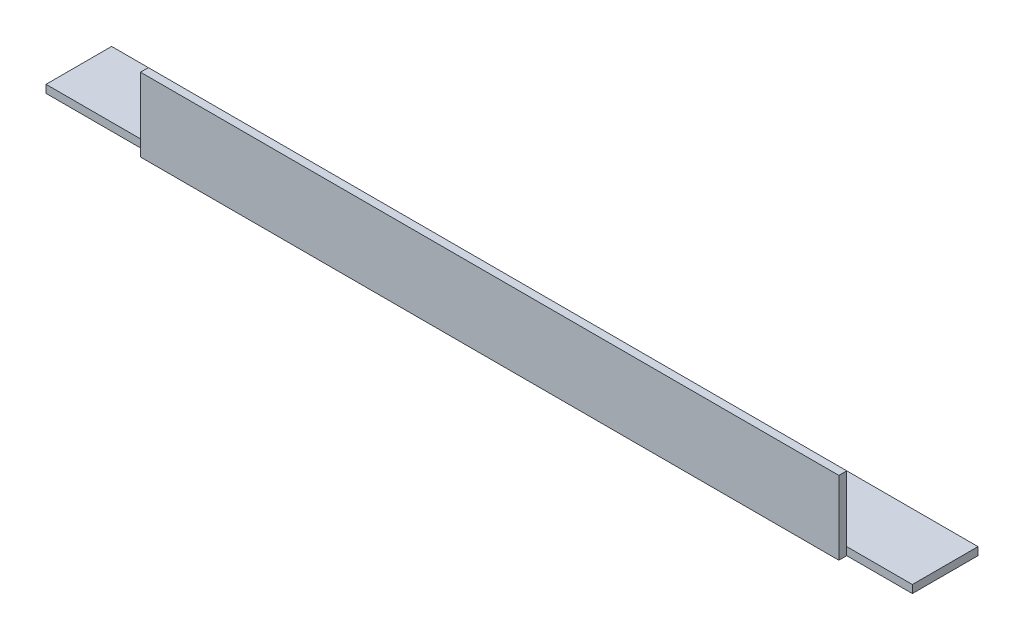
ISO-10303-21;
HEADER;
FILE_DESCRIPTION(('STEP AP214'),'2;1');
FILE_NAME('part.step','',(''),(''),'','','');
FILE_SCHEMA(('AUTOMOTIVE_DESIGN { 1 0 10303 214 1 1 1 1 }'));
ENDSEC;
DATA;
#1=APPLICATION_CONTEXT('core data for automotive mechanical design processes');
#2=APPLICATION_PROTOCOL_DEFINITION('international standard','automotive_design',2000,#1);
#3=PRODUCT_CONTEXT('',#1,'mechanical');
#4=PRODUCT('Part','Part','',(#3));
#5=PRODUCT_RELATED_PRODUCT_CATEGORY('part','',(#4));
#6=PRODUCT_DEFINITION_FORMATION('','',#4);
#7=PRODUCT_DEFINITION_CONTEXT('part definition',#1,'design');
#8=PRODUCT_DEFINITION('design','',#6,#7);
#9=PRODUCT_DEFINITION_SHAPE('','',#8);
#10=(LENGTH_UNIT() NAMED_UNIT(*) SI_UNIT(.MILLI.,.METRE.));
#11=(NAMED_UNIT(*) PLANE_ANGLE_UNIT() SI_UNIT($,.RADIAN.));
#12=(NAMED_UNIT(*) SI_UNIT($,.STERADIAN.) SOLID_ANGLE_UNIT());
#13=UNCERTAINTY_MEASURE_WITH_UNIT(LENGTH_MEASURE(1.E-05),#10,'distance_accuracy_value','');
#14=(GEOMETRIC_REPRESENTATION_CONTEXT(3) GLOBAL_UNCERTAINTY_ASSIGNED_CONTEXT((#13)) GLOBAL_UNIT_ASSIGNED_CONTEXT((#10,
#11,#12)) REPRESENTATION_CONTEXT('',''));
#15=CARTESIAN_POINT('',(0.,0.,0.));
#16=DIRECTION('',(0.,0.,1.));
#17=DIRECTION('',(1.,0.,0.));
#18=AXIS2_PLACEMENT_3D('',#15,#16,#17);
#19=CARTESIAN_POINT('',(330.,-3.,0.));
#20=DIRECTION('',(0.,1.,0.));
#21=DIRECTION('',(0.,0.,1.));
#22=AXIS2_PLACEMENT_3D('',#19,#20,#21);
#23=PLANE('',#22);
#24=DIRECTION('',(0.,0.,-1.));
#25=VECTOR('',#24,1.);
#26=CARTESIAN_POINT('',(330.,-3.,0.));
#27=LINE('',#26,#25);
#28=CARTESIAN_POINT('',(330.,-3.,0.));
#29=VERTEX_POINT('',#28);
#30=CARTESIAN_POINT('',(330.,-3.,-25.));
#31=VERTEX_POINT('',#30);
#32=EDGE_CURVE('E97',#29,#31,#27,.T.);
#33=ORIENTED_EDGE('',*,*,#32,.F.);
#34=DIRECTION('',(1.,0.,0.));
#35=VECTOR('',#34,1.);
#36=CARTESIAN_POINT('',(330.,-3.,0.));
#37=LINE('',#36,#35);
#38=CARTESIAN_POINT('',(305.,-3.,0.));
#39=VERTEX_POINT('',#38);
#40=EDGE_CURVE('E48',#39,#29,#37,.T.);
#41=ORIENTED_EDGE('',*,*,#40,.F.);
#42=DIRECTION('',(0.,0.,-1.));
#43=VECTOR('',#42,1.);
#44=CARTESIAN_POINT('',(305.,-3.,3.));
#45=LINE('',#44,#43);
#46=CARTESIAN_POINT('',(305.,-3.,3.));
#47=VERTEX_POINT('',#46);
#48=EDGE_CURVE('E150',#47,#39,#45,.T.);
#49=ORIENTED_EDGE('',*,*,#48,.F.);
#50=DIRECTION('',(-1.,0.,0.));
#51=VECTOR('',#50,1.);
#52=CARTESIAN_POINT('',(330.,-3.,3.));
#53=LINE('',#52,#51);
#54=CARTESIAN_POINT('',(39.,-3.,3.));
#55=VERTEX_POINT('',#54);
#56=EDGE_CURVE('E105',#47,#55,#53,.T.);
#57=ORIENTED_EDGE('',*,*,#56,.T.);
#58=DIRECTION('',(0.,0.,1.));
#59=VECTOR('',#58,1.);
#60=CARTESIAN_POINT('',(39.,-3.,3.));
#61=LINE('',#60,#59);
#62=CARTESIAN_POINT('',(39.,-3.,0.));
#63=VERTEX_POINT('',#62);
#64=EDGE_CURVE('E134',#63,#55,#61,.T.);
#65=ORIENTED_EDGE('',*,*,#64,.F.);
#66=DIRECTION('',(1.,0.,0.));
#67=VECTOR('',#66,1.);
#68=CARTESIAN_POINT('',(0.,-3.,0.));
#69=LINE('',#68,#67);
#70=CARTESIAN_POINT('',(0.,-3.,0.));
#71=VERTEX_POINT('',#70);
#72=EDGE_CURVE('E126',#71,#63,#69,.T.);
#73=ORIENTED_EDGE('',*,*,#72,.F.);
#74=DIRECTION('',(0.,0.,-1.));
#75=VECTOR('',#74,1.);
#76=CARTESIAN_POINT('',(0.,-3.,0.));
#77=LINE('',#76,#75);
#78=CARTESIAN_POINT('',(0.,-3.,-25.));
#79=VERTEX_POINT('',#78);
#80=EDGE_CURVE('E85',#71,#79,#77,.T.);
#81=ORIENTED_EDGE('',*,*,#80,.T.);
#82=DIRECTION('',(-1.,0.,0.));
#83=VECTOR('',#82,1.);
#84=CARTESIAN_POINT('',(330.,-3.,-25.));
#85=LINE('',#84,#83);
#86=EDGE_CURVE('E94',#31,#79,#85,.T.);
#87=ORIENTED_EDGE('',*,*,#86,.F.);
#88=EDGE_LOOP('',(#33,#41,#49,#57,#65,#73,#81,#87));
#89=FACE_BOUND('',#88,.T.);
#90=ADVANCED_FACE('F34',(#89),#23,.F.);
#91=CARTESIAN_POINT('',(330.,0.,-25.));
#92=DIRECTION('',(0.,0.,-1.));
#93=DIRECTION('',(-1.,0.,0.));
#94=AXIS2_PLACEMENT_3D('',#91,#92,#93);
#95=PLANE('',#94);
#96=DIRECTION('',(0.,-1.,0.));
#97=VECTOR('',#96,1.);
#98=CARTESIAN_POINT('',(0.,0.,-25.));
#99=LINE('',#98,#97);
#100=CARTESIAN_POINT('',(0.,0.,-25.));
#101=VERTEX_POINT('',#100);
#102=EDGE_CURVE('E98',#101,#79,#99,.T.);
#103=ORIENTED_EDGE('',*,*,#102,.F.);
#104=DIRECTION('',(-1.,0.,0.));
#105=VECTOR('',#104,1.);
#106=CARTESIAN_POINT('',(330.,0.,-25.));
#107=LINE('',#106,#105);
#108=CARTESIAN_POINT('',(330.,0.,-25.));
#109=VERTEX_POINT('',#108);
#110=EDGE_CURVE('E56',#109,#101,#107,.T.);
#111=ORIENTED_EDGE('',*,*,#110,.F.);
#112=DIRECTION('',(0.,-1.,0.));
#113=VECTOR('',#112,1.);
#114=CARTESIAN_POINT('',(330.,0.,-25.));
#115=LINE('',#114,#113);
#116=EDGE_CURVE('E100',#109,#31,#115,.T.);
#117=ORIENTED_EDGE('',*,*,#116,.T.);
#118=ORIENTED_EDGE('',*,*,#86,.T.);
#119=EDGE_LOOP('',(#103,#111,#117,#118));
#120=FACE_BOUND('',#119,.T.);
#121=ADVANCED_FACE('F122',(#120),#95,.T.);
#122=CARTESIAN_POINT('',(330.,0.,0.));
#123=DIRECTION('',(0.,1.,0.));
#124=DIRECTION('',(0.,0.,1.));
#125=AXIS2_PLACEMENT_3D('',#122,#123,#124);
#126=PLANE('',#125);
#127=DIRECTION('',(0.,0.,-1.));
#128=VECTOR('',#127,1.);
#129=CARTESIAN_POINT('',(0.,0.,0.));
#130=LINE('',#129,#128);
#131=CARTESIAN_POINT('',(0.,0.,0.));
#132=VERTEX_POINT('',#131);
#133=EDGE_CURVE('E93',#132,#101,#130,.T.);
#134=ORIENTED_EDGE('',*,*,#133,.F.);
#135=DIRECTION('',(-1.,0.,0.));
#136=VECTOR('',#135,1.);
#137=CARTESIAN_POINT('',(330.,0.,0.));
#138=LINE('',#137,#136);
#139=CARTESIAN_POINT('',(39.,0.,0.));
#140=VERTEX_POINT('',#139);
#141=EDGE_CURVE('E73',#140,#132,#138,.T.);
#142=ORIENTED_EDGE('',*,*,#141,.F.);
#143=DIRECTION('',(-1.,0.,0.));
#144=VECTOR('',#143,1.);
#145=CARTESIAN_POINT('',(330.,0.,0.));
#146=LINE('',#145,#144);
#147=CARTESIAN_POINT('',(305.,0.,0.));
#148=VERTEX_POINT('',#147);
#149=EDGE_CURVE('E115',#148,#140,#146,.T.);
#150=ORIENTED_EDGE('',*,*,#149,.F.);
#151=CARTESIAN_POINT('',(330.,0.,0.));
#152=VERTEX_POINT('',#151);
#153=EDGE_CURVE('E116',#152,#148,#146,.T.);
#154=ORIENTED_EDGE('',*,*,#153,.F.);
#155=DIRECTION('',(0.,0.,-1.));
#156=VECTOR('',#155,1.);
#157=CARTESIAN_POINT('',(330.,0.,0.));
#158=LINE('',#157,#156);
#159=EDGE_CURVE('E109',#152,#109,#158,.T.);
#160=ORIENTED_EDGE('',*,*,#159,.T.);
#161=ORIENTED_EDGE('',*,*,#110,.T.);
#162=EDGE_LOOP('',(#134,#142,#150,#154,#160,#161));
#163=FACE_BOUND('',#162,.T.);
#164=ADVANCED_FACE('F95',(#163),#126,.T.);
#165=CARTESIAN_POINT('',(330.,25.,0.));
#166=DIRECTION('',(0.,0.,-1.));
#167=DIRECTION('',(0.,1.,0.));
#168=AXIS2_PLACEMENT_3D('',#165,#166,#167);
#169=PLANE('',#168);
#170=DIRECTION('',(0.,-1.,0.));
#171=VECTOR('',#170,1.);
#172=CARTESIAN_POINT('',(305.,25.,0.));
#173=LINE('',#172,#171);
#174=CARTESIAN_POINT('',(305.,25.,0.));
#175=VERTEX_POINT('',#174);
#176=EDGE_CURVE('E139',#175,#148,#173,.T.);
#177=ORIENTED_EDGE('',*,*,#176,.T.);
#178=ORIENTED_EDGE('',*,*,#149,.T.);
#179=DIRECTION('',(0.,-1.,0.));
#180=VECTOR('',#179,1.);
#181=CARTESIAN_POINT('',(39.,25.,0.));
#182=LINE('',#181,#180);
#183=CARTESIAN_POINT('',(39.,25.,0.));
#184=VERTEX_POINT('',#183);
#185=EDGE_CURVE('E130',#184,#140,#182,.T.);
#186=ORIENTED_EDGE('',*,*,#185,.F.);
#187=DIRECTION('',(-1.,0.,0.));
#188=VECTOR('',#187,1.);
#189=CARTESIAN_POINT('',(330.,25.,0.));
#190=LINE('',#189,#188);
#191=EDGE_CURVE('E112',#175,#184,#190,.T.);
#192=ORIENTED_EDGE('',*,*,#191,.F.);
#193=EDGE_LOOP('',(#177,#178,#186,#192));
#194=FACE_BOUND('',#193,.T.);
#195=ADVANCED_FACE('F170',(#194),#169,.T.);
#196=CARTESIAN_POINT('',(330.,25.,3.));
#197=DIRECTION('',(0.,1.,0.));
#198=DIRECTION('',(0.,0.,1.));
#199=AXIS2_PLACEMENT_3D('',#196,#197,#198);
#200=PLANE('',#199);
#201=DIRECTION('',(0.,0.,-1.));
#202=VECTOR('',#201,1.);
#203=CARTESIAN_POINT('',(305.,25.,3.));
#204=LINE('',#203,#202);
#205=CARTESIAN_POINT('',(305.,25.,3.));
#206=VERTEX_POINT('',#205);
#207=EDGE_CURVE('E146',#206,#175,#204,.T.);
#208=ORIENTED_EDGE('',*,*,#207,.T.);
#209=ORIENTED_EDGE('',*,*,#191,.T.);
#210=DIRECTION('',(0.,0.,1.));
#211=VECTOR('',#210,1.);
#212=CARTESIAN_POINT('',(39.,25.,3.));
#213=LINE('',#212,#211);
#214=CARTESIAN_POINT('',(39.,25.,3.));
#215=VERTEX_POINT('',#214);
#216=EDGE_CURVE('E137',#184,#215,#213,.T.);
#217=ORIENTED_EDGE('',*,*,#216,.T.);
#218=DIRECTION('',(-1.,0.,0.));
#219=VECTOR('',#218,1.);
#220=CARTESIAN_POINT('',(330.,25.,3.));
#221=LINE('',#220,#219);
#222=EDGE_CURVE('E108',#206,#215,#221,.T.);
#223=ORIENTED_EDGE('',*,*,#222,.F.);
#224=EDGE_LOOP('',(#208,#209,#217,#223));
#225=FACE_BOUND('',#224,.T.);
#226=ADVANCED_FACE('F159',(#225),#200,.T.);
#227=CARTESIAN_POINT('',(330.,25.,3.));
#228=DIRECTION('',(0.,0.,-1.));
#229=DIRECTION('',(0.,1.,0.));
#230=AXIS2_PLACEMENT_3D('',#227,#228,#229);
#231=PLANE('',#230);
#232=ORIENTED_EDGE('',*,*,#56,.F.);
#233=DIRECTION('',(0.,-1.,0.));
#234=VECTOR('',#233,1.);
#235=CARTESIAN_POINT('',(305.,25.,3.));
#236=LINE('',#235,#234);
#237=EDGE_CURVE('E142',#206,#47,#236,.T.);
#238=ORIENTED_EDGE('',*,*,#237,.F.);
#239=ORIENTED_EDGE('',*,*,#222,.T.);
#240=DIRECTION('',(0.,-1.,0.));
#241=VECTOR('',#240,1.);
#242=CARTESIAN_POINT('',(39.,25.,3.));
#243=LINE('',#242,#241);
#244=EDGE_CURVE('E86',#215,#55,#243,.T.);
#245=ORIENTED_EDGE('',*,*,#244,.T.);
#246=EDGE_LOOP('',(#232,#238,#239,#245));
#247=FACE_BOUND('',#246,.T.);
#248=ADVANCED_FACE('F196',(#247),#231,.F.);
#249=CARTESIAN_POINT('',(330.,0.,0.));
#250=DIRECTION('',(-1.,0.,0.));
#251=DIRECTION('',(0.,0.,1.));
#252=AXIS2_PLACEMENT_3D('',#249,#250,#251);
#253=PLANE('',#252);
#254=ORIENTED_EDGE('',*,*,#159,.F.);
#255=DIRECTION('',(0.,-1.,0.));
#256=VECTOR('',#255,1.);
#257=CARTESIAN_POINT('',(330.,0.,0.));
#258=LINE('',#257,#256);
#259=EDGE_CURVE('E11',#152,#29,#258,.T.);
#260=ORIENTED_EDGE('',*,*,#259,.T.);
#261=ORIENTED_EDGE('',*,*,#32,.T.);
#262=ORIENTED_EDGE('',*,*,#116,.F.);
#263=EDGE_LOOP('',(#254,#260,#261,#262));
#264=FACE_BOUND('',#263,.T.);
#265=ADVANCED_FACE('F198',(#264),#253,.F.);
#266=CARTESIAN_POINT('',(0.,0.,0.));
#267=DIRECTION('',(-1.,0.,0.));
#268=DIRECTION('',(0.,0.,1.));
#269=AXIS2_PLACEMENT_3D('',#266,#267,#268);
#270=PLANE('',#269);
#271=DIRECTION('',(0.,-1.,0.));
#272=VECTOR('',#271,1.);
#273=CARTESIAN_POINT('',(0.,0.,0.));
#274=LINE('',#273,#272);
#275=EDGE_CURVE('E41',#132,#71,#274,.T.);
#276=ORIENTED_EDGE('',*,*,#275,.F.);
#277=ORIENTED_EDGE('',*,*,#133,.T.);
#278=ORIENTED_EDGE('',*,*,#102,.T.);
#279=ORIENTED_EDGE('',*,*,#80,.F.);
#280=EDGE_LOOP('',(#276,#277,#278,#279));
#281=FACE_BOUND('',#280,.T.);
#282=ADVANCED_FACE('F91',(#281),#270,.T.);
#283=CARTESIAN_POINT('',(39.,25.,3.));
#284=DIRECTION('',(1.,0.,0.));
#285=DIRECTION('',(0.,0.,-1.));
#286=AXIS2_PLACEMENT_3D('',#283,#284,#285);
#287=PLANE('',#286);
#288=ORIENTED_EDGE('',*,*,#64,.T.);
#289=ORIENTED_EDGE('',*,*,#244,.F.);
#290=ORIENTED_EDGE('',*,*,#216,.F.);
#291=ORIENTED_EDGE('',*,*,#185,.T.);
#292=EDGE_CURVE('E80',#140,#63,#182,.T.);
#293=ORIENTED_EDGE('',*,*,#292,.T.);
#294=EDGE_LOOP('',(#288,#289,#290,#291,#293));
#295=FACE_BOUND('',#294,.T.);
#296=ADVANCED_FACE('F176',(#295),#287,.F.);
#297=CARTESIAN_POINT('',(0.,25.,0.));
#298=DIRECTION('',(0.,0.,-1.));
#299=DIRECTION('',(-1.,0.,0.));
#300=AXIS2_PLACEMENT_3D('',#297,#298,#299);
#301=PLANE('',#300);
#302=ORIENTED_EDGE('',*,*,#141,.T.);
#303=ORIENTED_EDGE('',*,*,#275,.T.);
#304=ORIENTED_EDGE('',*,*,#72,.T.);
#305=ORIENTED_EDGE('',*,*,#292,.F.);
#306=EDGE_LOOP('',(#302,#303,#304,#305));
#307=FACE_BOUND('',#306,.T.);
#308=ADVANCED_FACE('F75',(#307),#301,.F.);
#309=CARTESIAN_POINT('',(330.,25.,0.));
#310=DIRECTION('',(0.,0.,-1.));
#311=DIRECTION('',(-1.,0.,0.));
#312=AXIS2_PLACEMENT_3D('',#309,#310,#311);
#313=PLANE('',#312);
#314=ORIENTED_EDGE('',*,*,#153,.T.);
#315=EDGE_CURVE('E145',#148,#39,#173,.T.);
#316=ORIENTED_EDGE('',*,*,#315,.T.);
#317=ORIENTED_EDGE('',*,*,#40,.T.);
#318=ORIENTED_EDGE('',*,*,#259,.F.);
#319=EDGE_LOOP('',(#314,#316,#317,#318));
#320=FACE_BOUND('',#319,.T.);
#321=ADVANCED_FACE('F260',(#320),#313,.F.);
#322=CARTESIAN_POINT('',(305.,25.,3.));
#323=DIRECTION('',(-1.,0.,0.));
#324=DIRECTION('',(0.,0.,1.));
#325=AXIS2_PLACEMENT_3D('',#322,#323,#324);
#326=PLANE('',#325);
#327=ORIENTED_EDGE('',*,*,#48,.T.);
#328=ORIENTED_EDGE('',*,*,#315,.F.);
#329=ORIENTED_EDGE('',*,*,#176,.F.);
#330=ORIENTED_EDGE('',*,*,#207,.F.);
#331=ORIENTED_EDGE('',*,*,#237,.T.);
#332=EDGE_LOOP('',(#327,#328,#329,#330,#331));
#333=FACE_BOUND('',#332,.T.);
#334=ADVANCED_FACE('F192',(#333),#326,.F.);
#335=CLOSED_SHELL('',(#90,#121,#164,#195,#226,#248,#265,#282,#296,#308,#321,#334));
#336=MANIFOLD_SOLID_BREP('B2',#335);
#337=ADVANCED_BREP_SHAPE_REPRESENTATION('',(#18,#336),#14);
#338=SHAPE_DEFINITION_REPRESENTATION(#9,#337);
ENDSEC;
END-ISO-10303-21;
